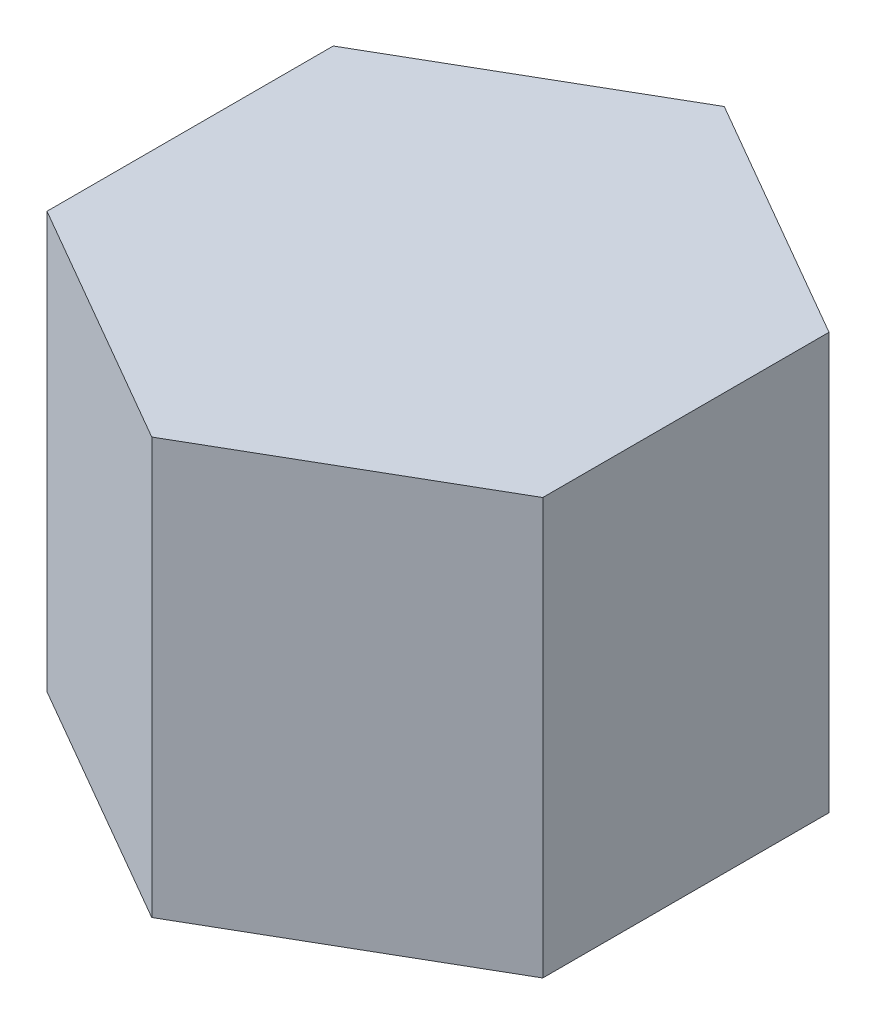
ISO-10303-21;
HEADER;
FILE_DESCRIPTION(('STEP AP214'),'2;1');
FILE_NAME('part.step','',(''),(''),'','','');
FILE_SCHEMA(('AUTOMOTIVE_DESIGN { 1 0 10303 214 1 1 1 1 }'));
ENDSEC;
DATA;
#1=APPLICATION_CONTEXT('core data for automotive mechanical design processes');
#2=APPLICATION_PROTOCOL_DEFINITION('international standard','automotive_design',2000,#1);
#3=PRODUCT_CONTEXT('',#1,'mechanical');
#4=PRODUCT('Part','Part','',(#3));
#5=PRODUCT_RELATED_PRODUCT_CATEGORY('part','',(#4));
#6=PRODUCT_DEFINITION_FORMATION('','',#4);
#7=PRODUCT_DEFINITION_CONTEXT('part definition',#1,'design');
#8=PRODUCT_DEFINITION('design','',#6,#7);
#9=PRODUCT_DEFINITION_SHAPE('','',#8);
#10=(LENGTH_UNIT() NAMED_UNIT(*) SI_UNIT(.MILLI.,.METRE.));
#11=(NAMED_UNIT(*) PLANE_ANGLE_UNIT() SI_UNIT($,.RADIAN.));
#12=(NAMED_UNIT(*) SI_UNIT($,.STERADIAN.) SOLID_ANGLE_UNIT());
#13=UNCERTAINTY_MEASURE_WITH_UNIT(LENGTH_MEASURE(1.E-05),#10,'distance_accuracy_value','');
#14=(GEOMETRIC_REPRESENTATION_CONTEXT(3) GLOBAL_UNCERTAINTY_ASSIGNED_CONTEXT((#13)) GLOBAL_UNIT_ASSIGNED_CONTEXT((#10,
#11,#12)) REPRESENTATION_CONTEXT('',''));
#15=CARTESIAN_POINT('',(0.,0.,0.));
#16=DIRECTION('',(0.,0.,1.));
#17=DIRECTION('',(1.,0.,0.));
#18=AXIS2_PLACEMENT_3D('',#15,#16,#17);
#19=CARTESIAN_POINT('',(208.839551417382,-147.556598747966,290.81594581671));
#20=DIRECTION('',(-0.500000000000028,0.,-0.866025403784422));
#21=DIRECTION('',(-0.866025403784423,0.,0.500000000000028));
#22=AXIS2_PLACEMENT_3D('',#19,#20,#21);
#23=PLANE('',#22);
#24=CARTESIAN_POINT('',(209.142660308706,-147.047793579175,290.64094581671));
#25=DIRECTION('',(-0.866025403784422,0.,0.500000000000028));
#26=VECTOR('',#25,1.);
#27=LINE('',#24,#26);
#28=CARTESIAN_POINT('',(209.142660308706,-147.047793579175,290.64094581671));
#29=VERTEX_POINT('',#28);
#30=CARTESIAN_POINT('',(208.839551417382,-147.047793579175,290.81594581671));
#31=VERTEX_POINT('',#30);
#32=EDGE_CURVE('E170',#29,#31,#27,.T.);
#33=ORIENTED_EDGE('',*,*,#32,.T.);
#34=CARTESIAN_POINT('',(208.839551417382,-147.556598747966,290.81594581671));
#35=DIRECTION('',(0.,1.,0.));
#36=VECTOR('',#35,1.);
#37=LINE('',#34,#36);
#38=CARTESIAN_POINT('',(208.839551417382,-147.556598747966,290.81594581671));
#39=VERTEX_POINT('',#38);
#40=EDGE_CURVE('E35',#39,#31,#37,.T.);
#41=ORIENTED_EDGE('',*,*,#40,.F.);
#42=CARTESIAN_POINT('',(209.142660308706,-147.556598747966,290.64094581671));
#43=DIRECTION('',(-0.866025403784422,0.,0.500000000000028));
#44=VECTOR('',#43,1.);
#45=LINE('',#42,#44);
#46=CARTESIAN_POINT('',(209.142660308706,-147.556598747966,290.64094581671));
#47=VERTEX_POINT('',#46);
#48=EDGE_CURVE('E159',#47,#39,#45,.T.);
#49=ORIENTED_EDGE('',*,*,#48,.F.);
#50=CARTESIAN_POINT('',(209.142660308706,-147.556598747966,290.64094581671));
#51=DIRECTION('',(0.,1.,0.));
#52=VECTOR('',#51,1.);
#53=LINE('',#50,#52);
#54=EDGE_CURVE('E10',#47,#29,#53,.T.);
#55=ORIENTED_EDGE('',*,*,#54,.T.);
#56=EDGE_LOOP('',(#33,#41,#49,#55));
#57=FACE_BOUND('',#56,.T.);
#58=ADVANCED_FACE('F16',(#57),#23,.F.);
#59=CARTESIAN_POINT('',(209.142660308706,-147.556598747966,291.594471220494));
#60=DIRECTION('',(-1.,0.,0.));
#61=DIRECTION('',(0.,-1.,0.));
#62=AXIS2_PLACEMENT_3D('',#59,#60,#61);
#63=PLANE('',#62);
#64=CARTESIAN_POINT('',(209.142660308706,-147.047793579175,290.29094581671));
#65=DIRECTION('',(0.,0.,1.));
#66=VECTOR('',#65,1.);
#67=LINE('',#64,#66);
#68=CARTESIAN_POINT('',(209.142660308706,-147.047793579175,290.29094581671));
#69=VERTEX_POINT('',#68);
#70=EDGE_CURVE('E167',#69,#29,#67,.T.);
#71=ORIENTED_EDGE('',*,*,#70,.T.);
#72=ORIENTED_EDGE('',*,*,#54,.F.);
#73=CARTESIAN_POINT('',(209.142660308706,-147.556598747966,290.29094581671));
#74=DIRECTION('',(0.,0.,1.));
#75=VECTOR('',#74,1.);
#76=LINE('',#73,#75);
#77=CARTESIAN_POINT('',(209.142660308706,-147.556598747966,290.29094581671));
#78=VERTEX_POINT('',#77);
#79=EDGE_CURVE('E156',#78,#47,#76,.T.);
#80=ORIENTED_EDGE('',*,*,#79,.F.);
#81=CARTESIAN_POINT('',(209.142660308706,-147.556598747966,290.29094581671));
#82=DIRECTION('',(0.,1.,0.));
#83=VECTOR('',#82,1.);
#84=LINE('',#81,#83);
#85=EDGE_CURVE('E27',#78,#69,#84,.T.);
#86=ORIENTED_EDGE('',*,*,#85,.T.);
#87=EDGE_LOOP('',(#71,#72,#80,#86));
#88=FACE_BOUND('',#87,.T.);
#89=ADVANCED_FACE('F189',(#88),#63,.F.);
#90=CARTESIAN_POINT('',(209.142660308706,-147.556598747966,290.29094581671));
#91=DIRECTION('',(-0.499999999999943,0.,0.866025403784471));
#92=DIRECTION('',(0.866025403784471,0.,0.499999999999943));
#93=AXIS2_PLACEMENT_3D('',#90,#91,#92);
#94=PLANE('',#93);
#95=CARTESIAN_POINT('',(208.839551417382,-147.047793579175,290.11594581671));
#96=DIRECTION('',(0.866025403784471,0.,0.499999999999943));
#97=VECTOR('',#96,1.);
#98=LINE('',#95,#97);
#99=CARTESIAN_POINT('',(208.839551417382,-147.047793579175,290.11594581671));
#100=VERTEX_POINT('',#99);
#101=EDGE_CURVE('E163',#100,#69,#98,.T.);
#102=ORIENTED_EDGE('',*,*,#101,.T.);
#103=ORIENTED_EDGE('',*,*,#85,.F.);
#104=CARTESIAN_POINT('',(208.839551417382,-147.556598747966,290.11594581671));
#105=DIRECTION('',(0.866025403784471,0.,0.499999999999943));
#106=VECTOR('',#105,1.);
#107=LINE('',#104,#106);
#108=CARTESIAN_POINT('',(208.839551417382,-147.556598747966,290.11594581671));
#109=VERTEX_POINT('',#108);
#110=EDGE_CURVE('E106',#109,#78,#107,.T.);
#111=ORIENTED_EDGE('',*,*,#110,.F.);
#112=CARTESIAN_POINT('',(208.839551417382,-147.556598747966,290.11594581671));
#113=DIRECTION('',(0.,1.,0.));
#114=VECTOR('',#113,1.);
#115=LINE('',#112,#114);
#116=EDGE_CURVE('E94',#109,#100,#115,.T.);
#117=ORIENTED_EDGE('',*,*,#116,.T.);
#118=EDGE_LOOP('',(#102,#103,#111,#117));
#119=FACE_BOUND('',#118,.T.);
#120=ADVANCED_FACE('F198',(#119),#94,.F.);
#121=CARTESIAN_POINT('',(208.839551417382,-147.556598747966,290.11594581671));
#122=DIRECTION('',(0.499999999999978,0.,0.866025403784452));
#123=DIRECTION('',(0.866025403784452,0.,-0.499999999999978));
#124=AXIS2_PLACEMENT_3D('',#121,#122,#123);
#125=PLANE('',#124);
#126=CARTESIAN_POINT('',(208.536442526057,-147.047793579175,290.29094581671));
#127=DIRECTION('',(0.866025403784452,0.,-0.499999999999978));
#128=VECTOR('',#127,1.);
#129=LINE('',#126,#128);
#130=CARTESIAN_POINT('',(208.536442526057,-147.047793579175,290.29094581671));
#131=VERTEX_POINT('',#130);
#132=EDGE_CURVE('E162',#131,#100,#129,.T.);
#133=ORIENTED_EDGE('',*,*,#132,.T.);
#134=ORIENTED_EDGE('',*,*,#116,.F.);
#135=CARTESIAN_POINT('',(208.536442526057,-147.556598747966,290.29094581671));
#136=DIRECTION('',(0.866025403784452,0.,-0.499999999999978));
#137=VECTOR('',#136,1.);
#138=LINE('',#135,#137);
#139=CARTESIAN_POINT('',(208.536442526057,-147.556598747966,290.29094581671));
#140=VERTEX_POINT('',#139);
#141=EDGE_CURVE('E98',#140,#109,#138,.T.);
#142=ORIENTED_EDGE('',*,*,#141,.F.);
#143=CARTESIAN_POINT('',(208.536442526057,-147.556598747966,290.29094581671));
#144=DIRECTION('',(0.,1.,0.));
#145=VECTOR('',#144,1.);
#146=LINE('',#143,#145);
#147=EDGE_CURVE('E79',#140,#131,#146,.T.);
#148=ORIENTED_EDGE('',*,*,#147,.T.);
#149=EDGE_LOOP('',(#133,#134,#142,#148));
#150=FACE_BOUND('',#149,.T.);
#151=ADVANCED_FACE('F100',(#150),#125,.F.);
#152=CARTESIAN_POINT('',(208.536442526057,-147.556598747966,291.594471220494));
#153=DIRECTION('',(1.,0.,0.));
#154=DIRECTION('',(0.,1.,0.));
#155=AXIS2_PLACEMENT_3D('',#152,#153,#154);
#156=PLANE('',#155);
#157=CARTESIAN_POINT('',(208.536442526057,-147.047793579175,290.64094581671));
#158=DIRECTION('',(0.,0.,-1.));
#159=VECTOR('',#158,1.);
#160=LINE('',#157,#159);
#161=CARTESIAN_POINT('',(208.536442526057,-147.047793579175,290.64094581671));
#162=VERTEX_POINT('',#161);
#163=EDGE_CURVE('E88',#162,#131,#160,.T.);
#164=ORIENTED_EDGE('',*,*,#163,.T.);
#165=ORIENTED_EDGE('',*,*,#147,.F.);
#166=CARTESIAN_POINT('',(208.536442526057,-147.556598747966,290.64094581671));
#167=DIRECTION('',(0.,0.,-1.));
#168=VECTOR('',#167,1.);
#169=LINE('',#166,#168);
#170=CARTESIAN_POINT('',(208.536442526057,-147.556598747966,290.64094581671));
#171=VERTEX_POINT('',#170);
#172=EDGE_CURVE('E84',#171,#140,#169,.T.);
#173=ORIENTED_EDGE('',*,*,#172,.F.);
#174=CARTESIAN_POINT('',(208.536442526057,-147.556598747966,290.64094581671));
#175=DIRECTION('',(0.,1.,0.));
#176=VECTOR('',#175,1.);
#177=LINE('',#174,#176);
#178=EDGE_CURVE('E58',#171,#162,#177,.T.);
#179=ORIENTED_EDGE('',*,*,#178,.T.);
#180=EDGE_LOOP('',(#164,#165,#173,#179));
#181=FACE_BOUND('',#180,.T.);
#182=ADVANCED_FACE('F82',(#181),#156,.F.);
#183=CARTESIAN_POINT('',(208.536442526057,-147.556598747966,290.64094581671));
#184=DIRECTION('',(0.499999999999978,0.,-0.866025403784452));
#185=DIRECTION('',(-0.866025403784452,0.,-0.499999999999978));
#186=AXIS2_PLACEMENT_3D('',#183,#184,#185);
#187=PLANE('',#186);
#188=CARTESIAN_POINT('',(208.839551417382,-147.047793579175,290.81594581671));
#189=DIRECTION('',(-0.866025403784452,0.,-0.499999999999978));
#190=VECTOR('',#189,1.);
#191=LINE('',#188,#190);
#192=EDGE_CURVE('E160',#31,#162,#191,.T.);
#193=ORIENTED_EDGE('',*,*,#192,.T.);
#194=ORIENTED_EDGE('',*,*,#178,.F.);
#195=CARTESIAN_POINT('',(208.839551417382,-147.556598747966,290.81594581671));
#196=DIRECTION('',(-0.866025403784452,0.,-0.499999999999978));
#197=VECTOR('',#196,1.);
#198=LINE('',#195,#197);
#199=EDGE_CURVE('E112',#39,#171,#198,.T.);
#200=ORIENTED_EDGE('',*,*,#199,.F.);
#201=ORIENTED_EDGE('',*,*,#40,.T.);
#202=EDGE_LOOP('',(#193,#194,#200,#201));
#203=FACE_BOUND('',#202,.T.);
#204=ADVANCED_FACE('F131',(#203),#187,.F.);
#205=CARTESIAN_POINT('',(206.491105863044,-147.556598747966,291.594471220494));
#206=DIRECTION('',(0.,1.,0.));
#207=DIRECTION('',(-1.,0.,0.));
#208=AXIS2_PLACEMENT_3D('',#205,#206,#207);
#209=PLANE('',#208);
#210=ORIENTED_EDGE('',*,*,#48,.T.);
#211=ORIENTED_EDGE('',*,*,#199,.T.);
#212=ORIENTED_EDGE('',*,*,#172,.T.);
#213=ORIENTED_EDGE('',*,*,#141,.T.);
#214=ORIENTED_EDGE('',*,*,#110,.T.);
#215=ORIENTED_EDGE('',*,*,#79,.T.);
#216=EDGE_LOOP('',(#210,#211,#212,#213,#214,#215));
#217=FACE_BOUND('',#216,.T.);
#218=ADVANCED_FACE('F111',(#217),#209,.F.);
#219=CARTESIAN_POINT('',(206.491105863044,-147.047793579175,291.594471220494));
#220=DIRECTION('',(0.,1.,0.));
#221=DIRECTION('',(-1.,0.,0.));
#222=AXIS2_PLACEMENT_3D('',#219,#220,#221);
#223=PLANE('',#222);
#224=ORIENTED_EDGE('',*,*,#32,.F.);
#225=ORIENTED_EDGE('',*,*,#70,.F.);
#226=ORIENTED_EDGE('',*,*,#101,.F.);
#227=ORIENTED_EDGE('',*,*,#132,.F.);
#228=ORIENTED_EDGE('',*,*,#163,.F.);
#229=ORIENTED_EDGE('',*,*,#192,.F.);
#230=EDGE_LOOP('',(#224,#225,#226,#227,#228,#229));
#231=FACE_BOUND('',#230,.T.);
#232=ADVANCED_FACE('F130',(#231),#223,.T.);
#233=CLOSED_SHELL('',(#58,#89,#120,#151,#182,#204,#218,#232));
#234=MANIFOLD_SOLID_BREP('B1',#233);
#235=ADVANCED_BREP_SHAPE_REPRESENTATION('',(#18,#234),#14);
#236=SHAPE_DEFINITION_REPRESENTATION(#9,#235);
ENDSEC;
END-ISO-10303-21;
